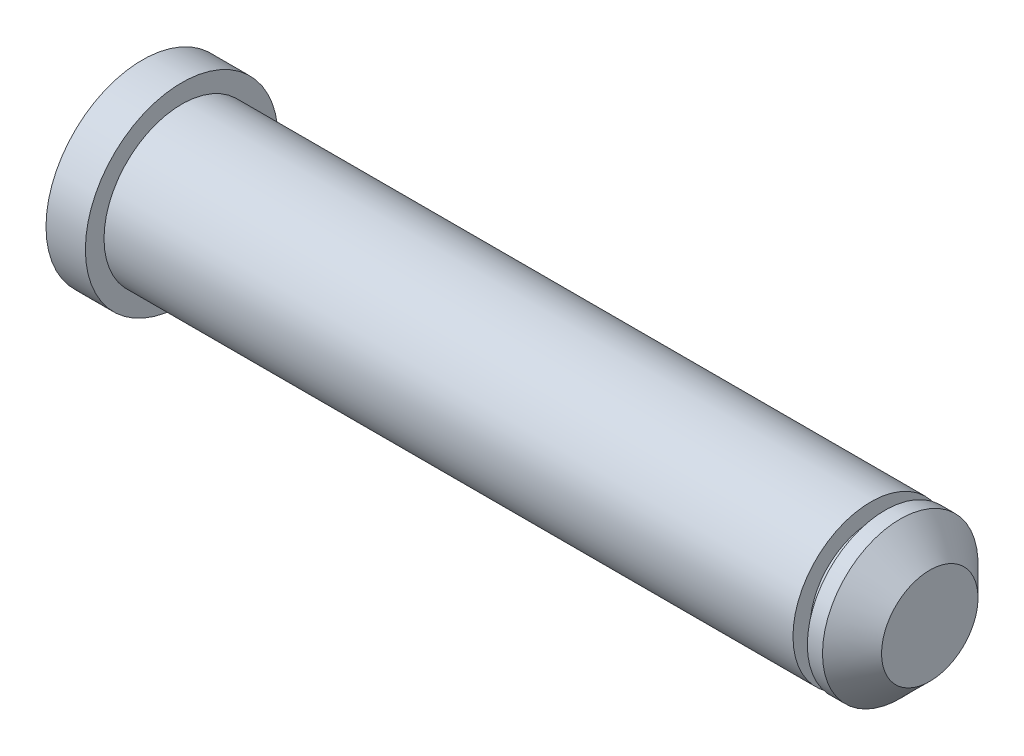
ISO-10303-21;
HEADER;
FILE_DESCRIPTION(('STEP AP214'),'2;1');
FILE_NAME('part.step','',(''),(''),'','','');
FILE_SCHEMA(('AUTOMOTIVE_DESIGN { 1 0 10303 214 1 1 1 1 }'));
ENDSEC;
DATA;
#1=APPLICATION_CONTEXT('core data for automotive mechanical design processes');
#2=APPLICATION_PROTOCOL_DEFINITION('international standard','automotive_design',2000,#1);
#3=PRODUCT_CONTEXT('',#1,'mechanical');
#4=PRODUCT('Part','Part','',(#3));
#5=PRODUCT_RELATED_PRODUCT_CATEGORY('part','',(#4));
#6=PRODUCT_DEFINITION_FORMATION('','',#4);
#7=PRODUCT_DEFINITION_CONTEXT('part definition',#1,'design');
#8=PRODUCT_DEFINITION('design','',#6,#7);
#9=PRODUCT_DEFINITION_SHAPE('','',#8);
#10=(LENGTH_UNIT() NAMED_UNIT(*) SI_UNIT(.MILLI.,.METRE.));
#11=(NAMED_UNIT(*) PLANE_ANGLE_UNIT() SI_UNIT($,.RADIAN.));
#12=(NAMED_UNIT(*) SI_UNIT($,.STERADIAN.) SOLID_ANGLE_UNIT());
#13=UNCERTAINTY_MEASURE_WITH_UNIT(LENGTH_MEASURE(1.E-05),#10,'distance_accuracy_value','');
#14=(GEOMETRIC_REPRESENTATION_CONTEXT(3) GLOBAL_UNCERTAINTY_ASSIGNED_CONTEXT((#13)) GLOBAL_UNIT_ASSIGNED_CONTEXT((#10,
#11,#12)) REPRESENTATION_CONTEXT('',''));
#15=CARTESIAN_POINT('',(0.,0.,0.));
#16=DIRECTION('',(0.,0.,1.));
#17=DIRECTION('',(1.,0.,0.));
#18=AXIS2_PLACEMENT_3D('',#15,#16,#17);
#19=CARTESIAN_POINT('',(0.,0.,0.));
#20=DIRECTION('',(1.,0.,0.));
#21=DIRECTION('',(0.,0.,-1.));
#22=AXIS2_PLACEMENT_3D('',#19,#20,#21);
#23=PLANE('',#22);
#24=CARTESIAN_POINT('',(0.,0.,0.));
#25=DIRECTION('',(-1.,0.,0.));
#26=DIRECTION('',(0.,0.,1.));
#27=AXIS2_PLACEMENT_3D('',#24,#25,#26);
#28=CIRCLE('',#27,4.89664155494938);
#29=CARTESIAN_POINT('',(0.,0.,4.89664155494938));
#30=VERTEX_POINT('',#29);
#31=EDGE_CURVE('E10',#30,#30,#28,.T.);
#32=ORIENTED_EDGE('',*,*,#31,.T.);
#33=EDGE_LOOP('',(#32));
#34=FACE_BOUND('',#33,.T.);
#35=ADVANCED_FACE('F33',(#34),#23,.F.);
#36=CARTESIAN_POINT('',(0.,0.,0.));
#37=DIRECTION('',(-1.,0.,0.));
#38=DIRECTION('',(0.,0.,1.));
#39=AXIS2_PLACEMENT_3D('',#36,#37,#38);
#40=CYLINDRICAL_SURFACE('',#39,4.89664155494938);
#41=ORIENTED_EDGE('',*,*,#31,.F.);
#42=EDGE_LOOP('',(#41));
#43=FACE_BOUND('',#42,.T.);
#44=CARTESIAN_POINT('',(2.,0.,0.));
#45=DIRECTION('',(-1.,0.,0.));
#46=DIRECTION('',(0.,0.,1.));
#47=AXIS2_PLACEMENT_3D('',#44,#45,#46);
#48=CIRCLE('',#47,4.89664155494938);
#49=CARTESIAN_POINT('',(2.,0.,4.89664155494938));
#50=VERTEX_POINT('',#49);
#51=EDGE_CURVE('E39',#50,#50,#48,.T.);
#52=ORIENTED_EDGE('',*,*,#51,.T.);
#53=EDGE_LOOP('',(#52));
#54=FACE_BOUND('',#53,.T.);
#55=ADVANCED_FACE('F80',(#43,#54),#40,.T.);
#56=CARTESIAN_POINT('',(2.,4.89664155494938,0.));
#57=DIRECTION('',(-1.,0.,0.));
#58=DIRECTION('',(0.,0.,1.));
#59=AXIS2_PLACEMENT_3D('',#56,#57,#58);
#60=PLANE('',#59);
#61=ORIENTED_EDGE('',*,*,#51,.F.);
#62=EDGE_LOOP('',(#61));
#63=FACE_BOUND('',#62,.T.);
#64=CARTESIAN_POINT('',(2.,0.,0.));
#65=DIRECTION('',(-1.,0.,0.));
#66=DIRECTION('',(0.,0.,1.));
#67=AXIS2_PLACEMENT_3D('',#64,#65,#66);
#68=CIRCLE('',#67,3.95);
#69=CARTESIAN_POINT('',(2.,0.,3.95));
#70=VERTEX_POINT('',#69);
#71=EDGE_CURVE('E43',#70,#70,#68,.T.);
#72=ORIENTED_EDGE('',*,*,#71,.T.);
#73=EDGE_LOOP('',(#72));
#74=FACE_BOUND('',#73,.T.);
#75=ADVANCED_FACE('F84',(#63,#74),#60,.F.);
#76=CARTESIAN_POINT('',(0.,0.,0.));
#77=DIRECTION('',(-1.,0.,0.));
#78=DIRECTION('',(0.,0.,1.));
#79=AXIS2_PLACEMENT_3D('',#76,#77,#78);
#80=CYLINDRICAL_SURFACE('',#79,3.95);
#81=ORIENTED_EDGE('',*,*,#71,.F.);
#82=EDGE_LOOP('',(#81));
#83=FACE_BOUND('',#82,.T.);
#84=CARTESIAN_POINT('',(37.,0.,0.));
#85=DIRECTION('',(-1.,0.,0.));
#86=DIRECTION('',(0.,0.,1.));
#87=AXIS2_PLACEMENT_3D('',#84,#85,#86);
#88=CIRCLE('',#87,3.95);
#89=CARTESIAN_POINT('',(37.,0.,3.95));
#90=VERTEX_POINT('',#89);
#91=EDGE_CURVE('E47',#90,#90,#88,.T.);
#92=ORIENTED_EDGE('',*,*,#91,.T.);
#93=EDGE_LOOP('',(#92));
#94=FACE_BOUND('',#93,.T.);
#95=ADVANCED_FACE('F89',(#83,#94),#80,.T.);
#96=CARTESIAN_POINT('',(37.,3.95,0.));
#97=DIRECTION('',(-1.,0.,0.));
#98=DIRECTION('',(0.,0.,1.));
#99=AXIS2_PLACEMENT_3D('',#96,#97,#98);
#100=PLANE('',#99);
#101=ORIENTED_EDGE('',*,*,#91,.F.);
#102=EDGE_LOOP('',(#101));
#103=FACE_BOUND('',#102,.T.);
#104=CARTESIAN_POINT('',(37.,0.,0.));
#105=DIRECTION('',(-1.,0.,0.));
#106=DIRECTION('',(0.,0.,1.));
#107=AXIS2_PLACEMENT_3D('',#104,#105,#106);
#108=CIRCLE('',#107,3.08);
#109=CARTESIAN_POINT('',(37.,0.,3.08));
#110=VERTEX_POINT('',#109);
#111=EDGE_CURVE('E52',#110,#110,#108,.T.);
#112=ORIENTED_EDGE('',*,*,#111,.T.);
#113=EDGE_LOOP('',(#112));
#114=FACE_BOUND('',#113,.T.);
#115=ADVANCED_FACE('F95',(#103,#114),#100,.F.);
#116=CARTESIAN_POINT('',(0.,0.,0.));
#117=DIRECTION('',(-1.,0.,0.));
#118=DIRECTION('',(0.,0.,1.));
#119=AXIS2_PLACEMENT_3D('',#116,#117,#118);
#120=CYLINDRICAL_SURFACE('',#119,3.08);
#121=ORIENTED_EDGE('',*,*,#111,.F.);
#122=EDGE_LOOP('',(#121));
#123=FACE_BOUND('',#122,.T.);
#124=CARTESIAN_POINT('',(37.73,0.,0.));
#125=DIRECTION('',(-1.,0.,0.));
#126=DIRECTION('',(0.,0.,1.));
#127=AXIS2_PLACEMENT_3D('',#124,#125,#126);
#128=CIRCLE('',#127,3.08);
#129=CARTESIAN_POINT('',(37.73,0.,3.08));
#130=VERTEX_POINT('',#129);
#131=EDGE_CURVE('E55',#130,#130,#128,.T.);
#132=ORIENTED_EDGE('',*,*,#131,.T.);
#133=EDGE_LOOP('',(#132));
#134=FACE_BOUND('',#133,.T.);
#135=ADVANCED_FACE('F99',(#123,#134),#120,.T.);
#136=CARTESIAN_POINT('',(37.73,3.08,0.));
#137=DIRECTION('',(1.,0.,0.));
#138=DIRECTION('',(0.,0.,-1.));
#139=AXIS2_PLACEMENT_3D('',#136,#137,#138);
#140=PLANE('',#139);
#141=ORIENTED_EDGE('',*,*,#131,.F.);
#142=EDGE_LOOP('',(#141));
#143=FACE_BOUND('',#142,.T.);
#144=CARTESIAN_POINT('',(37.73,0.,0.));
#145=DIRECTION('',(-1.,0.,0.));
#146=DIRECTION('',(0.,0.,1.));
#147=AXIS2_PLACEMENT_3D('',#144,#145,#146);
#148=CIRCLE('',#147,3.95);
#149=CARTESIAN_POINT('',(37.73,0.,3.95));
#150=VERTEX_POINT('',#149);
#151=EDGE_CURVE('E58',#150,#150,#148,.T.);
#152=ORIENTED_EDGE('',*,*,#151,.T.);
#153=EDGE_LOOP('',(#152));
#154=FACE_BOUND('',#153,.T.);
#155=ADVANCED_FACE('F103',(#143,#154),#140,.F.);
#156=CARTESIAN_POINT('',(0.,0.,0.));
#157=DIRECTION('',(-1.,0.,0.));
#158=DIRECTION('',(0.,0.,1.));
#159=AXIS2_PLACEMENT_3D('',#156,#157,#158);
#160=CYLINDRICAL_SURFACE('',#159,3.95);
#161=ORIENTED_EDGE('',*,*,#151,.F.);
#162=EDGE_LOOP('',(#161));
#163=FACE_BOUND('',#162,.T.);
#164=CARTESIAN_POINT('',(38.5,0.,0.));
#165=DIRECTION('',(-1.,0.,0.));
#166=DIRECTION('',(0.,0.,1.));
#167=AXIS2_PLACEMENT_3D('',#164,#165,#166);
#168=CIRCLE('',#167,3.95);
#169=CARTESIAN_POINT('',(38.5,0.,3.95));
#170=VERTEX_POINT('',#169);
#171=EDGE_CURVE('E61',#170,#170,#168,.T.);
#172=ORIENTED_EDGE('',*,*,#171,.T.);
#173=EDGE_LOOP('',(#172));
#174=FACE_BOUND('',#173,.T.);
#175=ADVANCED_FACE('F76',(#163,#174),#160,.T.);
#176=CARTESIAN_POINT('',(40.,0.,0.));
#177=DIRECTION('',(-1.,0.,0.));
#178=DIRECTION('',(0.,0.,1.));
#179=AXIS2_PLACEMENT_3D('',#176,#177,#178);
#180=CONICAL_SURFACE('',#179,2.45,0.78539816339745);
#181=ORIENTED_EDGE('',*,*,#171,.F.);
#182=EDGE_LOOP('',(#181));
#183=FACE_BOUND('',#182,.T.);
#184=CARTESIAN_POINT('',(40.,0.,0.));
#185=DIRECTION('',(-1.,0.,0.));
#186=DIRECTION('',(0.,0.,1.));
#187=AXIS2_PLACEMENT_3D('',#184,#185,#186);
#188=CIRCLE('',#187,2.45);
#189=CARTESIAN_POINT('',(40.,0.,2.45));
#190=VERTEX_POINT('',#189);
#191=EDGE_CURVE('E64',#190,#190,#188,.T.);
#192=ORIENTED_EDGE('',*,*,#191,.T.);
#193=EDGE_LOOP('',(#192));
#194=FACE_BOUND('',#193,.T.);
#195=ADVANCED_FACE('F68',(#183,#194),#180,.T.);
#196=CARTESIAN_POINT('',(40.,2.45,0.));
#197=DIRECTION('',(-1.,0.,0.));
#198=DIRECTION('',(0.,0.,1.));
#199=AXIS2_PLACEMENT_3D('',#196,#197,#198);
#200=PLANE('',#199);
#201=ORIENTED_EDGE('',*,*,#191,.F.);
#202=EDGE_LOOP('',(#201));
#203=FACE_BOUND('',#202,.T.);
#204=ADVANCED_FACE('F70',(#203),#200,.F.);
#205=CLOSED_SHELL('',(#35,#55,#75,#95,#115,#135,#155,#175,#195,#204));
#206=MANIFOLD_SOLID_BREP('B2',#205);
#207=ADVANCED_BREP_SHAPE_REPRESENTATION('',(#18,#206),#14);
#208=SHAPE_DEFINITION_REPRESENTATION(#9,#207);
ENDSEC;
END-ISO-10303-21;
